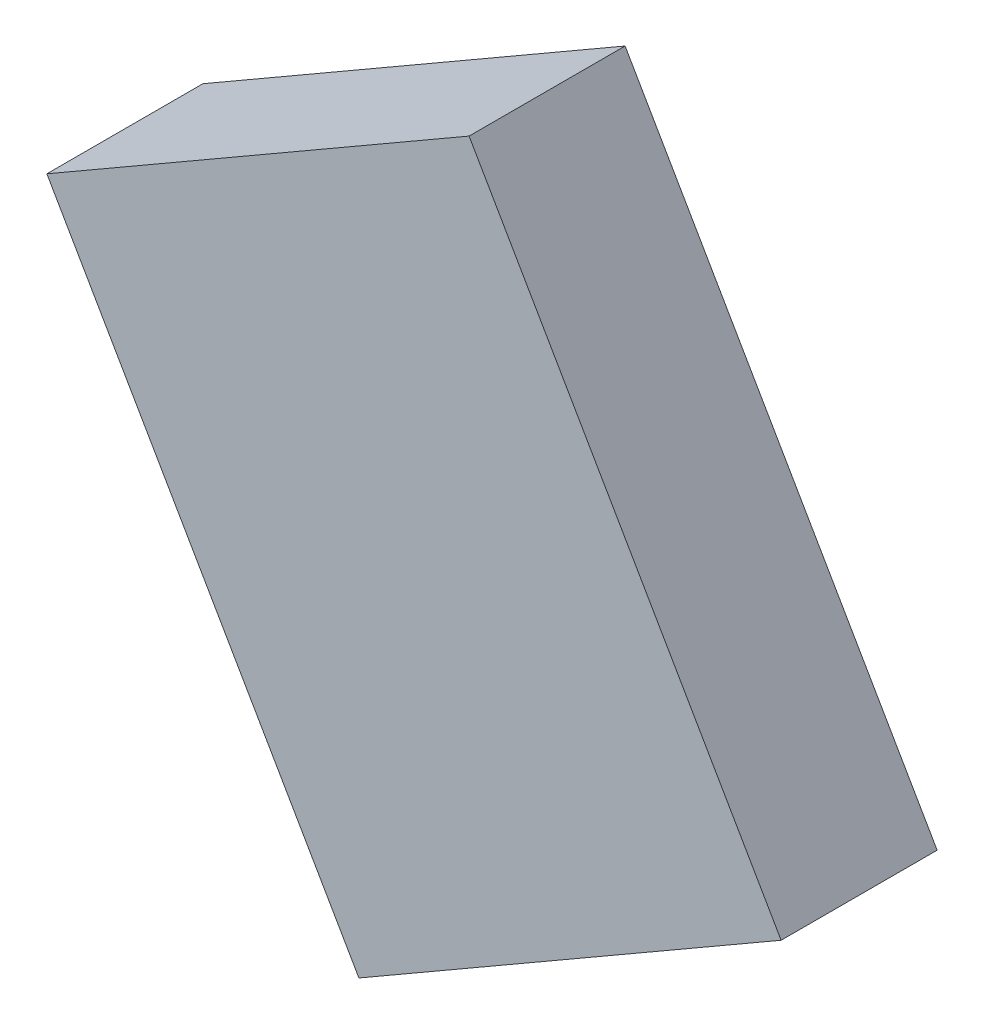
ISO-10303-21;
HEADER;
FILE_DESCRIPTION(('STEP AP214'),'2;1');
FILE_NAME('part.step','',(''),(''),'','','');
FILE_SCHEMA(('AUTOMOTIVE_DESIGN { 1 0 10303 214 1 1 1 1 }'));
ENDSEC;
DATA;
#1=APPLICATION_CONTEXT('core data for automotive mechanical design processes');
#2=APPLICATION_PROTOCOL_DEFINITION('international standard','automotive_design',2000,#1);
#3=PRODUCT_CONTEXT('',#1,'mechanical');
#4=PRODUCT('Part','Part','',(#3));
#5=PRODUCT_RELATED_PRODUCT_CATEGORY('part','',(#4));
#6=PRODUCT_DEFINITION_FORMATION('','',#4);
#7=PRODUCT_DEFINITION_CONTEXT('part definition',#1,'design');
#8=PRODUCT_DEFINITION('design','',#6,#7);
#9=PRODUCT_DEFINITION_SHAPE('','',#8);
#10=(LENGTH_UNIT() NAMED_UNIT(*) SI_UNIT(.MILLI.,.METRE.));
#11=(NAMED_UNIT(*) PLANE_ANGLE_UNIT() SI_UNIT($,.RADIAN.));
#12=(NAMED_UNIT(*) SI_UNIT($,.STERADIAN.) SOLID_ANGLE_UNIT());
#13=UNCERTAINTY_MEASURE_WITH_UNIT(LENGTH_MEASURE(1.E-05),#10,'distance_accuracy_value','');
#14=(GEOMETRIC_REPRESENTATION_CONTEXT(3) GLOBAL_UNCERTAINTY_ASSIGNED_CONTEXT((#13)) GLOBAL_UNIT_ASSIGNED_CONTEXT((#10,
#11,#12)) REPRESENTATION_CONTEXT('',''));
#15=CARTESIAN_POINT('',(0.,0.,0.));
#16=DIRECTION('',(0.,0.,1.));
#17=DIRECTION('',(1.,0.,0.));
#18=AXIS2_PLACEMENT_3D('',#15,#16,#17);
#19=CARTESIAN_POINT('',(-1.88253116,0.7606411,0.80000094));
#20=DIRECTION('',(0.,0.,-1.));
#21=DIRECTION('',(-1.,0.,0.));
#22=AXIS2_PLACEMENT_3D('',#19,#20,#21);
#23=PLANE('',#22);
#24=DIRECTION('',(-0.866024903968885,-0.500000865704934,0.));
#25=VECTOR('',#24,1.);
#26=CARTESIAN_POINT('',(-0.28253182,-2.01064114,0.80000094));
#27=LINE('',#26,#25);
#28=CARTESIAN_POINT('',(-0.282531820000206,-2.01064114000012,0.80000094));
#29=VERTEX_POINT('',#28);
#30=CARTESIAN_POINT('',(1.88253115999996,-0.760638559999925,0.80000094));
#31=VERTEX_POINT('',#30);
#32=EDGE_CURVE('E54',#29,#31,#27,.F.);
#33=ORIENTED_EDGE('',*,*,#32,.T.);
#34=DIRECTION('',(0.500000060750926,-0.866025368709872,0.));
#35=VECTOR('',#34,1.);
#36=CARTESIAN_POINT('',(1.88253116,-0.76063856,0.80000094));
#37=LINE('',#36,#35);
#38=CARTESIAN_POINT('',(0.282531820000269,2.01064114000016,0.80000094));
#39=VERTEX_POINT('',#38);
#40=EDGE_CURVE('E56',#31,#39,#37,.F.);
#41=ORIENTED_EDGE('',*,*,#40,.T.);
#42=DIRECTION('',(0.866025343910241,0.500000103705139,0.));
#43=VECTOR('',#42,1.);
#44=CARTESIAN_POINT('',(0.28253182,2.01064114,0.80000094));
#45=LINE('',#44,#43);
#46=CARTESIAN_POINT('',(-1.88253116000016,0.760641100000285,0.80000094));
#47=VERTEX_POINT('',#46);
#48=EDGE_CURVE('E19',#39,#47,#45,.F.);
#49=ORIENTED_EDGE('',*,*,#48,.T.);
#50=DIRECTION('',(-0.499999717047159,0.866025567147276,0.));
#51=VECTOR('',#50,1.);
#52=CARTESIAN_POINT('',(-1.88253116,0.7606411,0.80000094));
#53=LINE('',#52,#51);
#54=EDGE_CURVE('E79',#47,#29,#53,.F.);
#55=ORIENTED_EDGE('',*,*,#54,.T.);
#56=EDGE_LOOP('',(#33,#41,#49,#55));
#57=FACE_BOUND('',#56,.T.);
#58=ADVANCED_FACE('F16',(#57),#23,.F.);
#59=CARTESIAN_POINT('',(0.28253182,2.01064114,0.));
#60=DIRECTION('',(0.500000103705139,-0.866025343910241,0.));
#61=DIRECTION('',(0.866025343910241,0.500000103705139,0.));
#62=AXIS2_PLACEMENT_3D('',#59,#60,#61);
#63=PLANE('',#62);
#64=DIRECTION('',(0.,0.,1.));
#65=VECTOR('',#64,1.);
#66=CARTESIAN_POINT('',(-1.88253116,0.7606411,0.));
#67=LINE('',#66,#65);
#68=CARTESIAN_POINT('',(-1.88253116000016,0.760641100000285,0.));
#69=VERTEX_POINT('',#68);
#70=EDGE_CURVE('E67',#69,#47,#67,.T.);
#71=ORIENTED_EDGE('',*,*,#70,.T.);
#72=ORIENTED_EDGE('',*,*,#48,.F.);
#73=DIRECTION('',(0.,0.,1.));
#74=VECTOR('',#73,1.);
#75=CARTESIAN_POINT('',(0.282531820001077,2.01064114000062,0.));
#76=LINE('',#75,#74);
#77=CARTESIAN_POINT('',(0.282531820000269,2.01064114000016,0.));
#78=VERTEX_POINT('',#77);
#79=EDGE_CURVE('E62',#39,#78,#76,.F.);
#80=ORIENTED_EDGE('',*,*,#79,.T.);
#81=DIRECTION('',(0.866025343910109,0.500000103705367,0.));
#82=VECTOR('',#81,1.);
#83=CARTESIAN_POINT('',(-1.88253116,0.7606411,0.));
#84=LINE('',#83,#82);
#85=EDGE_CURVE('E82',#69,#78,#84,.T.);
#86=ORIENTED_EDGE('',*,*,#85,.F.);
#87=EDGE_LOOP('',(#71,#72,#80,#86));
#88=FACE_BOUND('',#87,.T.);
#89=ADVANCED_FACE('F64',(#88),#63,.F.);
#90=CARTESIAN_POINT('',(1.88253116,-0.76063856,0.));
#91=DIRECTION('',(-0.866025368709872,-0.500000060750926,0.));
#92=DIRECTION('',(0.500000060750926,-0.866025368709872,0.));
#93=AXIS2_PLACEMENT_3D('',#90,#91,#92);
#94=PLANE('',#93);
#95=ORIENTED_EDGE('',*,*,#79,.F.);
#96=ORIENTED_EDGE('',*,*,#40,.F.);
#97=DIRECTION('',(0.,0.,1.));
#98=VECTOR('',#97,1.);
#99=CARTESIAN_POINT('',(1.88253115999983,-0.760638559999701,0.));
#100=LINE('',#99,#98);
#101=CARTESIAN_POINT('',(1.88253115999996,-0.760638559999925,0.));
#102=VERTEX_POINT('',#101);
#103=EDGE_CURVE('E74',#31,#102,#100,.F.);
#104=ORIENTED_EDGE('',*,*,#103,.T.);
#105=DIRECTION('',(0.500000060751263,-0.866025368709678,0.));
#106=VECTOR('',#105,1.);
#107=CARTESIAN_POINT('',(0.28253182,2.01064114,0.));
#108=LINE('',#107,#106);
#109=EDGE_CURVE('E71',#78,#102,#108,.T.);
#110=ORIENTED_EDGE('',*,*,#109,.F.);
#111=EDGE_LOOP('',(#95,#96,#104,#110));
#112=FACE_BOUND('',#111,.T.);
#113=ADVANCED_FACE('F69',(#112),#94,.F.);
#114=CARTESIAN_POINT('',(-0.28253182,-2.01064114,0.));
#115=DIRECTION('',(-0.500000865704934,0.866024903968885,0.));
#116=DIRECTION('',(-0.866024903968885,-0.500000865704934,0.));
#117=AXIS2_PLACEMENT_3D('',#114,#115,#116);
#118=PLANE('',#117);
#119=ORIENTED_EDGE('',*,*,#103,.F.);
#120=ORIENTED_EDGE('',*,*,#32,.F.);
#121=DIRECTION('',(0.,0.,1.));
#122=VECTOR('',#121,1.);
#123=CARTESIAN_POINT('',(-0.282531820000822,-2.01064114000048,0.));
#124=LINE('',#123,#122);
#125=CARTESIAN_POINT('',(-0.282531820000206,-2.01064114000012,0.));
#126=VERTEX_POINT('',#125);
#127=EDGE_CURVE('E34',#29,#126,#124,.F.);
#128=ORIENTED_EDGE('',*,*,#127,.T.);
#129=DIRECTION('',(-0.866024903968954,-0.500000865704814,0.));
#130=VECTOR('',#129,1.);
#131=CARTESIAN_POINT('',(1.88253116,-0.76063856,0.));
#132=LINE('',#131,#130);
#133=EDGE_CURVE('E25',#102,#126,#132,.T.);
#134=ORIENTED_EDGE('',*,*,#133,.F.);
#135=EDGE_LOOP('',(#119,#120,#128,#134));
#136=FACE_BOUND('',#135,.T.);
#137=ADVANCED_FACE('F88',(#136),#118,.F.);
#138=CARTESIAN_POINT('',(-1.88253116,0.7606411,0.));
#139=DIRECTION('',(0.866025567147276,0.499999717047159,0.));
#140=DIRECTION('',(-0.499999717047159,0.866025567147276,0.));
#141=AXIS2_PLACEMENT_3D('',#138,#139,#140);
#142=PLANE('',#141);
#143=ORIENTED_EDGE('',*,*,#127,.F.);
#144=ORIENTED_EDGE('',*,*,#54,.F.);
#145=ORIENTED_EDGE('',*,*,#70,.F.);
#146=DIRECTION('',(-0.499999717047416,0.866025567147127,0.));
#147=VECTOR('',#146,1.);
#148=CARTESIAN_POINT('',(-0.28253182,-2.01064114,0.));
#149=LINE('',#148,#147);
#150=EDGE_CURVE('E11',#126,#69,#149,.T.);
#151=ORIENTED_EDGE('',*,*,#150,.F.);
#152=EDGE_LOOP('',(#143,#144,#145,#151));
#153=FACE_BOUND('',#152,.T.);
#154=ADVANCED_FACE('F90',(#153),#142,.F.);
#155=CARTESIAN_POINT('',(-1.88253116,0.7606411,0.));
#156=DIRECTION('',(0.,0.,-1.));
#157=DIRECTION('',(-1.,0.,0.));
#158=AXIS2_PLACEMENT_3D('',#155,#156,#157);
#159=PLANE('',#158);
#160=ORIENTED_EDGE('',*,*,#133,.T.);
#161=ORIENTED_EDGE('',*,*,#150,.T.);
#162=ORIENTED_EDGE('',*,*,#85,.T.);
#163=ORIENTED_EDGE('',*,*,#109,.T.);
#164=EDGE_LOOP('',(#160,#161,#162,#163));
#165=FACE_BOUND('',#164,.T.);
#166=ADVANCED_FACE('F87',(#165),#159,.T.);
#167=CLOSED_SHELL('',(#58,#89,#113,#137,#154,#166));
#168=MANIFOLD_SOLID_BREP('B1',#167);
#169=ADVANCED_BREP_SHAPE_REPRESENTATION('',(#18,#168),#14);
#170=SHAPE_DEFINITION_REPRESENTATION(#9,#169);
ENDSEC;
END-ISO-10303-21;
